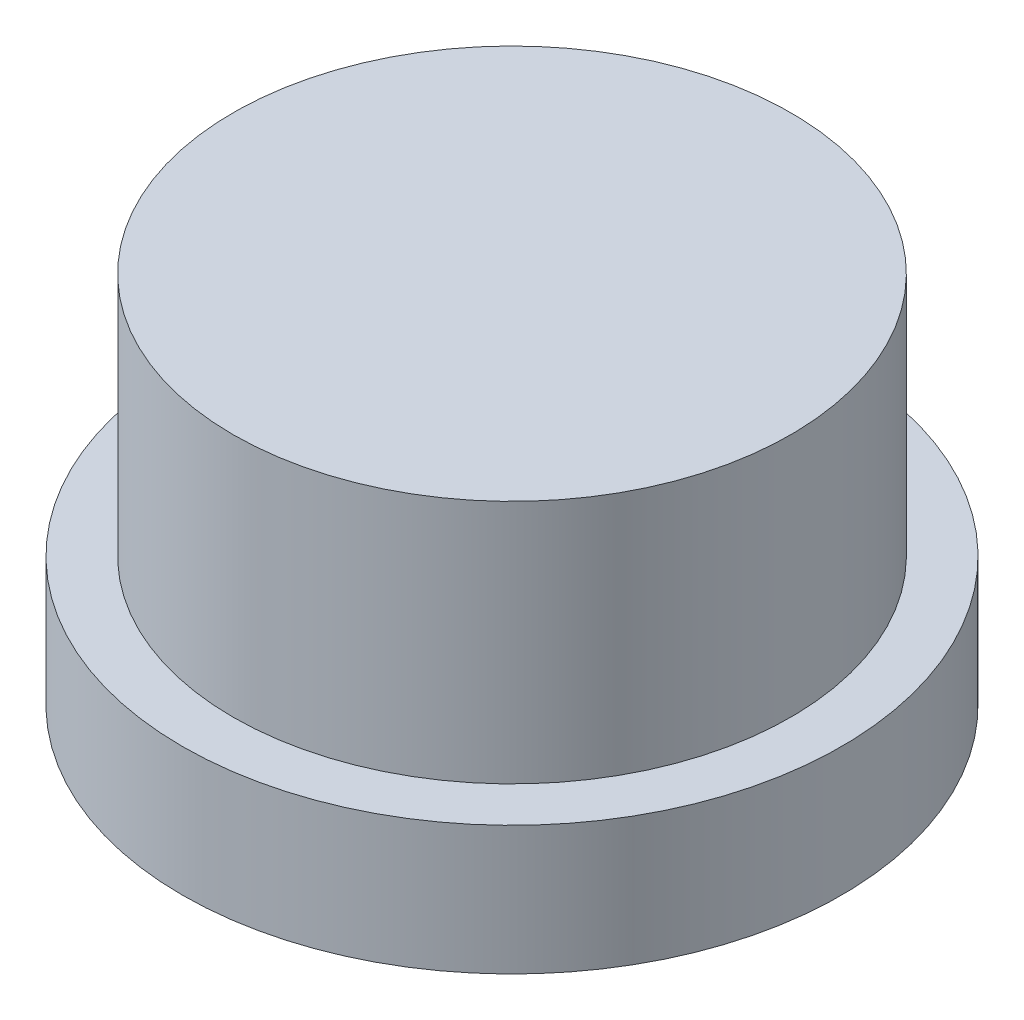
ISO-10303-21;
HEADER;
FILE_DESCRIPTION(('STEP AP214'),'2;1');
FILE_NAME('part.step','',(''),(''),'','','');
FILE_SCHEMA(('AUTOMOTIVE_DESIGN { 1 0 10303 214 1 1 1 1 }'));
ENDSEC;
DATA;
#1=APPLICATION_CONTEXT('core data for automotive mechanical design processes');
#2=APPLICATION_PROTOCOL_DEFINITION('international standard','automotive_design',2000,#1);
#3=PRODUCT_CONTEXT('',#1,'mechanical');
#4=PRODUCT('Part','Part','',(#3));
#5=PRODUCT_RELATED_PRODUCT_CATEGORY('part','',(#4));
#6=PRODUCT_DEFINITION_FORMATION('','',#4);
#7=PRODUCT_DEFINITION_CONTEXT('part definition',#1,'design');
#8=PRODUCT_DEFINITION('design','',#6,#7);
#9=PRODUCT_DEFINITION_SHAPE('','',#8);
#10=(LENGTH_UNIT() NAMED_UNIT(*) SI_UNIT(.MILLI.,.METRE.));
#11=(NAMED_UNIT(*) PLANE_ANGLE_UNIT() SI_UNIT($,.RADIAN.));
#12=(NAMED_UNIT(*) SI_UNIT($,.STERADIAN.) SOLID_ANGLE_UNIT());
#13=UNCERTAINTY_MEASURE_WITH_UNIT(LENGTH_MEASURE(1.E-05),#10,'distance_accuracy_value','');
#14=(GEOMETRIC_REPRESENTATION_CONTEXT(3) GLOBAL_UNCERTAINTY_ASSIGNED_CONTEXT((#13)) GLOBAL_UNIT_ASSIGNED_CONTEXT((#10,
#11,#12)) REPRESENTATION_CONTEXT('',''));
#15=CARTESIAN_POINT('',(0.,0.,0.));
#16=DIRECTION('',(0.,0.,1.));
#17=DIRECTION('',(1.,0.,0.));
#18=AXIS2_PLACEMENT_3D('',#15,#16,#17);
#19=CARTESIAN_POINT('',(0.,2.54,0.));
#20=DIRECTION('',(0.,-1.,0.));
#21=DIRECTION('',(0.,0.,-1.));
#22=AXIS2_PLACEMENT_3D('',#19,#20,#21);
#23=CYLINDRICAL_SURFACE('',#22,6.5);
#24=CARTESIAN_POINT('',(0.,2.54,0.));
#25=DIRECTION('',(0.,1.,0.));
#26=DIRECTION('',(0.,0.,1.));
#27=AXIS2_PLACEMENT_3D('',#24,#25,#26);
#28=CIRCLE('',#27,6.5);
#29=CARTESIAN_POINT('',(0.,2.54,6.5));
#30=VERTEX_POINT('',#29);
#31=EDGE_CURVE('E38',#30,#30,#28,.T.);
#32=ORIENTED_EDGE('',*,*,#31,.F.);
#33=EDGE_LOOP('',(#32));
#34=FACE_BOUND('',#33,.T.);
#35=CARTESIAN_POINT('',(0.,0.,0.));
#36=DIRECTION('',(0.,1.,0.));
#37=DIRECTION('',(0.,0.,1.));
#38=AXIS2_PLACEMENT_3D('',#35,#36,#37);
#39=CIRCLE('',#38,6.5);
#40=CARTESIAN_POINT('',(0.,0.,6.5));
#41=VERTEX_POINT('',#40);
#42=EDGE_CURVE('E34',#41,#41,#39,.T.);
#43=ORIENTED_EDGE('',*,*,#42,.T.);
#44=EDGE_LOOP('',(#43));
#45=FACE_BOUND('',#44,.T.);
#46=ADVANCED_FACE('F31',(#34,#45),#23,.T.);
#47=CARTESIAN_POINT('',(0.,2.54,0.));
#48=DIRECTION('',(0.,1.,0.));
#49=DIRECTION('',(0.,0.,1.));
#50=AXIS2_PLACEMENT_3D('',#47,#48,#49);
#51=PLANE('',#50);
#52=CARTESIAN_POINT('',(0.,2.54,0.));
#53=DIRECTION('',(0.,1.,0.));
#54=DIRECTION('',(0.,0.,1.));
#55=AXIS2_PLACEMENT_3D('',#52,#53,#54);
#56=CIRCLE('',#55,5.5);
#57=CARTESIAN_POINT('',(0.,2.54,5.5));
#58=VERTEX_POINT('',#57);
#59=EDGE_CURVE('E10',#58,#58,#56,.T.);
#60=ORIENTED_EDGE('',*,*,#59,.F.);
#61=EDGE_LOOP('',(#60));
#62=FACE_BOUND('',#61,.T.);
#63=ORIENTED_EDGE('',*,*,#31,.T.);
#64=EDGE_LOOP('',(#63));
#65=FACE_BOUND('',#64,.T.);
#66=ADVANCED_FACE('F55',(#62,#65),#51,.T.);
#67=CARTESIAN_POINT('',(0.,0.,0.));
#68=DIRECTION('',(0.,1.,0.));
#69=DIRECTION('',(0.,0.,1.));
#70=AXIS2_PLACEMENT_3D('',#67,#68,#69);
#71=PLANE('',#70);
#72=ORIENTED_EDGE('',*,*,#42,.F.);
#73=EDGE_LOOP('',(#72));
#74=FACE_BOUND('',#73,.T.);
#75=ADVANCED_FACE('F52',(#74),#71,.F.);
#76=CARTESIAN_POINT('',(0.,7.366,0.));
#77=DIRECTION('',(0.,-1.,0.));
#78=DIRECTION('',(0.,0.,-1.));
#79=AXIS2_PLACEMENT_3D('',#76,#77,#78);
#80=CYLINDRICAL_SURFACE('',#79,5.5);
#81=CARTESIAN_POINT('',(0.,7.366,0.));
#82=DIRECTION('',(0.,1.,0.));
#83=DIRECTION('',(0.,0.,1.));
#84=AXIS2_PLACEMENT_3D('',#81,#82,#83);
#85=CIRCLE('',#84,5.5);
#86=CARTESIAN_POINT('',(0.,7.366,5.5));
#87=VERTEX_POINT('',#86);
#88=EDGE_CURVE('E44',#87,#87,#85,.T.);
#89=ORIENTED_EDGE('',*,*,#88,.F.);
#90=EDGE_LOOP('',(#89));
#91=FACE_BOUND('',#90,.T.);
#92=ORIENTED_EDGE('',*,*,#59,.T.);
#93=EDGE_LOOP('',(#92));
#94=FACE_BOUND('',#93,.T.);
#95=ADVANCED_FACE('F54',(#91,#94),#80,.T.);
#96=CARTESIAN_POINT('',(0.,7.366,0.));
#97=DIRECTION('',(0.,1.,0.));
#98=DIRECTION('',(0.,0.,1.));
#99=AXIS2_PLACEMENT_3D('',#96,#97,#98);
#100=PLANE('',#99);
#101=ORIENTED_EDGE('',*,*,#88,.T.);
#102=EDGE_LOOP('',(#101));
#103=FACE_BOUND('',#102,.T.);
#104=ADVANCED_FACE('F60',(#103),#100,.T.);
#105=CLOSED_SHELL('',(#46,#66,#75,#95,#104));
#106=MANIFOLD_SOLID_BREP('B2',#105);
#107=ADVANCED_BREP_SHAPE_REPRESENTATION('',(#18,#106),#14);
#108=SHAPE_DEFINITION_REPRESENTATION(#9,#107);
ENDSEC;
END-ISO-10303-21;
